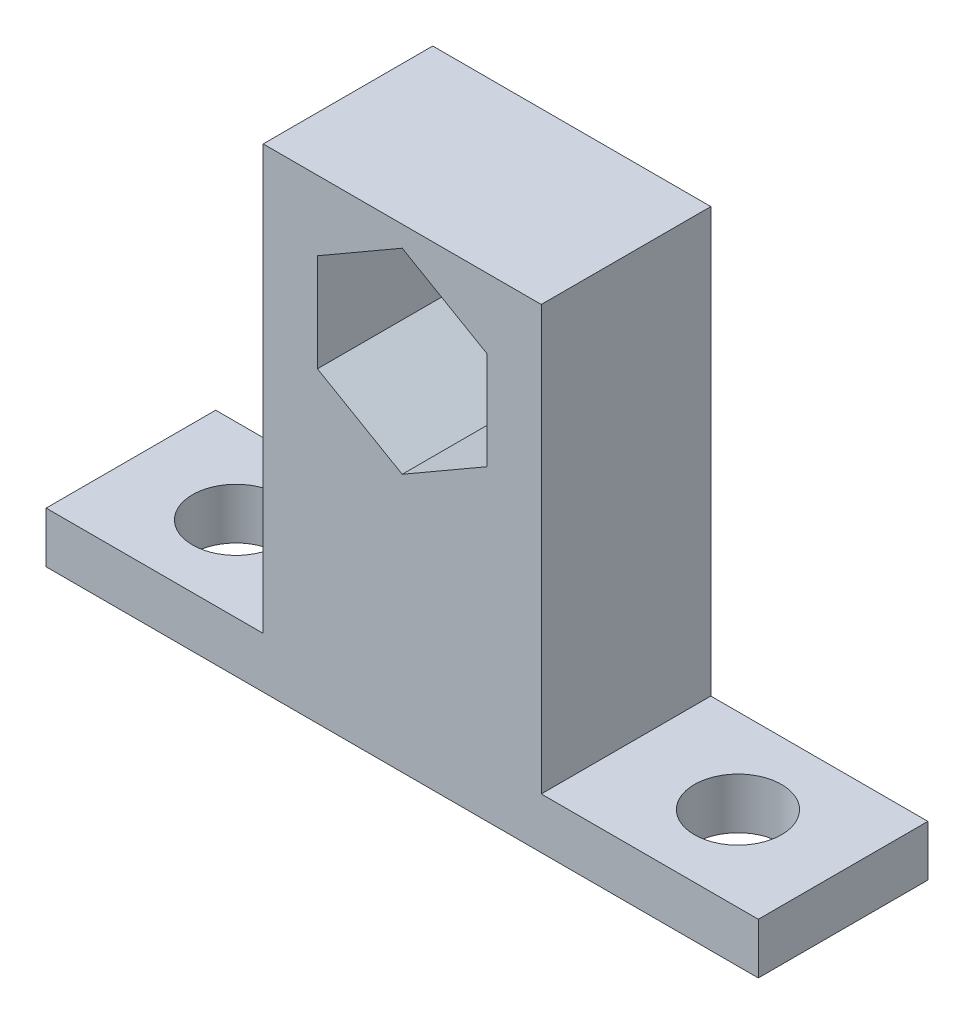
ISO-10303-21;
HEADER;
FILE_DESCRIPTION(('STEP AP214'),'2;1');
FILE_NAME('part.step','',(''),(''),'','','');
FILE_SCHEMA(('AUTOMOTIVE_DESIGN { 1 0 10303 214 1 1 1 1 }'));
ENDSEC;
DATA;
#1=APPLICATION_CONTEXT('core data for automotive mechanical design processes');
#2=APPLICATION_PROTOCOL_DEFINITION('international standard','automotive_design',2000,#1);
#3=PRODUCT_CONTEXT('',#1,'mechanical');
#4=PRODUCT('Part','Part','',(#3));
#5=PRODUCT_RELATED_PRODUCT_CATEGORY('part','',(#4));
#6=PRODUCT_DEFINITION_FORMATION('','',#4);
#7=PRODUCT_DEFINITION_CONTEXT('part definition',#1,'design');
#8=PRODUCT_DEFINITION('design','',#6,#7);
#9=PRODUCT_DEFINITION_SHAPE('','',#8);
#10=(LENGTH_UNIT() NAMED_UNIT(*) SI_UNIT(.MILLI.,.METRE.));
#11=(NAMED_UNIT(*) PLANE_ANGLE_UNIT() SI_UNIT($,.RADIAN.));
#12=(NAMED_UNIT(*) SI_UNIT($,.STERADIAN.) SOLID_ANGLE_UNIT());
#13=UNCERTAINTY_MEASURE_WITH_UNIT(LENGTH_MEASURE(1.E-05),#10,'distance_accuracy_value','');
#14=(GEOMETRIC_REPRESENTATION_CONTEXT(3) GLOBAL_UNCERTAINTY_ASSIGNED_CONTEXT((#13)) GLOBAL_UNIT_ASSIGNED_CONTEXT((#10,
#11,#12)) REPRESENTATION_CONTEXT('',''));
#15=CARTESIAN_POINT('',(0.,0.,0.));
#16=DIRECTION('',(0.,0.,1.));
#17=DIRECTION('',(1.,0.,0.));
#18=AXIS2_PLACEMENT_3D('',#15,#16,#17);
#19=CARTESIAN_POINT('',(0.,3.81,0.));
#20=DIRECTION('',(0.,1.,0.));
#21=DIRECTION('',(0.,0.,1.));
#22=AXIS2_PLACEMENT_3D('',#19,#20,#21);
#23=PLANE('',#22);
#24=DIRECTION('',(0.,0.,1.));
#25=VECTOR('',#24,1.);
#26=CARTESIAN_POINT('',(-19.1250455281497,3.81,9.58609075441454));
#27=LINE('',#26,#25);
#28=CARTESIAN_POINT('',(-19.1250455281497,3.81,-3.11390924558546));
#29=VERTEX_POINT('',#28);
#30=CARTESIAN_POINT('',(-19.1250455281497,3.81,9.58609075441454));
#31=VERTEX_POINT('',#30);
#32=EDGE_CURVE('E151',#29,#31,#27,.T.);
#33=ORIENTED_EDGE('',*,*,#32,.F.);
#34=DIRECTION('',(1.,0.,0.));
#35=VECTOR('',#34,1.);
#36=CARTESIAN_POINT('',(0.,3.81,-3.11390924558546));
#37=LINE('',#36,#35);
#38=CARTESIAN_POINT('',(-35.3810455281497,3.81,-3.11390924558546));
#39=VERTEX_POINT('',#38);
#40=EDGE_CURVE('E274',#39,#29,#37,.T.);
#41=ORIENTED_EDGE('',*,*,#40,.F.);
#42=DIRECTION('',(0.,0.,1.));
#43=VECTOR('',#42,1.);
#44=CARTESIAN_POINT('',(-35.3810455281497,3.81,0.));
#45=LINE('',#44,#43);
#46=CARTESIAN_POINT('',(-35.3810455281497,3.81,9.58609075441454));
#47=VERTEX_POINT('',#46);
#48=EDGE_CURVE('E272',#39,#47,#45,.T.);
#49=ORIENTED_EDGE('',*,*,#48,.T.);
#50=DIRECTION('',(1.,0.,0.));
#51=VECTOR('',#50,1.);
#52=CARTESIAN_POINT('',(0.,3.81,9.58609075441454));
#53=LINE('',#52,#51);
#54=EDGE_CURVE('E259',#47,#31,#53,.T.);
#55=ORIENTED_EDGE('',*,*,#54,.T.);
#56=EDGE_LOOP('',(#33,#41,#49,#55));
#57=FACE_BOUND('',#56,.T.);
#58=CARTESIAN_POINT('',(-27.5070455281497,3.81,3.23609075441454));
#59=DIRECTION('',(0.,1.,0.));
#60=DIRECTION('',(0.,0.,1.));
#61=AXIS2_PLACEMENT_3D('',#58,#59,#60);
#62=CIRCLE('',#61,3.2639);
#63=CARTESIAN_POINT('',(-27.5070455281497,3.81,6.49999075441454));
#64=VERTEX_POINT('',#63);
#65=EDGE_CURVE('E252',#64,#64,#62,.T.);
#66=ORIENTED_EDGE('',*,*,#65,.F.);
#67=EDGE_LOOP('',(#66));
#68=FACE_BOUND('',#67,.T.);
#69=ADVANCED_FACE('F35',(#57,#68),#23,.T.);
#70=CARTESIAN_POINT('',(0.,3.81,9.58609075441454));
#71=DIRECTION('',(0.,0.,-1.));
#72=DIRECTION('',(-1.,0.,0.));
#73=AXIS2_PLACEMENT_3D('',#70,#71,#72);
#74=PLANE('',#73);
#75=DIRECTION('',(0.,-1.,0.));
#76=VECTOR('',#75,1.);
#77=CARTESIAN_POINT('',(-15.0610455281497,23.0038257906459,9.58609075441454));
#78=LINE('',#77,#76);
#79=CARTESIAN_POINT('',(-15.0610455281497,30.3361742093541,9.58609075441454));
#80=VERTEX_POINT('',#79);
#81=CARTESIAN_POINT('',(-15.0610455281497,23.0038257906459,9.58609075441454));
#82=VERTEX_POINT('',#81);
#83=EDGE_CURVE('E158',#80,#82,#78,.T.);
#84=ORIENTED_EDGE('',*,*,#83,.F.);
#85=DIRECTION('',(-0.866025403784438,-0.5,0.));
#86=VECTOR('',#85,1.);
#87=CARTESIAN_POINT('',(-15.0610455281497,30.3361742093541,9.58609075441454));
#88=LINE('',#87,#86);
#89=CARTESIAN_POINT('',(-8.71104552814974,34.0023484187082,9.58609075441454));
#90=VERTEX_POINT('',#89);
#91=EDGE_CURVE('E139',#90,#80,#88,.T.);
#92=ORIENTED_EDGE('',*,*,#91,.F.);
#93=DIRECTION('',(-0.866025403784439,0.5,0.));
#94=VECTOR('',#93,1.);
#95=CARTESIAN_POINT('',(-8.71104552814974,34.0023484187082,9.58609075441454));
#96=LINE('',#95,#94);
#97=CARTESIAN_POINT('',(-2.36104552814974,30.3361742093541,9.58609075441454));
#98=VERTEX_POINT('',#97);
#99=EDGE_CURVE('E148',#98,#90,#96,.T.);
#100=ORIENTED_EDGE('',*,*,#99,.F.);
#101=DIRECTION('',(0.,1.,0.));
#102=VECTOR('',#101,1.);
#103=CARTESIAN_POINT('',(-2.36104552814974,30.3361742093541,9.58609075441454));
#104=LINE('',#103,#102);
#105=CARTESIAN_POINT('',(-2.36104552814974,23.0038257906459,9.58609075441454));
#106=VERTEX_POINT('',#105);
#107=EDGE_CURVE('E52',#106,#98,#104,.T.);
#108=ORIENTED_EDGE('',*,*,#107,.F.);
#109=DIRECTION('',(0.866025403784439,0.5,0.));
#110=VECTOR('',#109,1.);
#111=CARTESIAN_POINT('',(-2.36104552814974,23.0038257906459,9.58609075441454));
#112=LINE('',#111,#110);
#113=CARTESIAN_POINT('',(-8.71104552814974,19.3376515812918,9.58609075441454));
#114=VERTEX_POINT('',#113);
#115=EDGE_CURVE('E482',#114,#106,#112,.T.);
#116=ORIENTED_EDGE('',*,*,#115,.F.);
#117=DIRECTION('',(0.866025403784439,-0.5,0.));
#118=VECTOR('',#117,1.);
#119=CARTESIAN_POINT('',(-8.71104552814974,19.3376515812918,9.58609075441454));
#120=LINE('',#119,#118);
#121=EDGE_CURVE('E162',#82,#114,#120,.T.);
#122=ORIENTED_EDGE('',*,*,#121,.F.);
#123=EDGE_LOOP('',(#84,#92,#100,#108,#116,#122));
#124=FACE_BOUND('',#123,.T.);
#125=DIRECTION('',(1.,0.,0.));
#126=VECTOR('',#125,1.);
#127=CARTESIAN_POINT('',(0.,0.,9.58609075441454));
#128=LINE('',#127,#126);
#129=CARTESIAN_POINT('',(-35.3810455281497,0.,9.58609075441454));
#130=VERTEX_POINT('',#129);
#131=CARTESIAN_POINT('',(17.9589544718503,0.,9.58609075441454));
#132=VERTEX_POINT('',#131);
#133=EDGE_CURVE('E231',#130,#132,#128,.T.);
#134=ORIENTED_EDGE('',*,*,#133,.T.);
#135=DIRECTION('',(0.,-1.,0.));
#136=VECTOR('',#135,1.);
#137=CARTESIAN_POINT('',(17.9589544718503,3.81,9.58609075441454));
#138=LINE('',#137,#136);
#139=CARTESIAN_POINT('',(17.9589544718503,3.81,9.58609075441454));
#140=VERTEX_POINT('',#139);
#141=EDGE_CURVE('E11',#140,#132,#138,.T.);
#142=ORIENTED_EDGE('',*,*,#141,.F.);
#143=CARTESIAN_POINT('',(1.70295447185026,3.81,9.58609075441454));
#144=VERTEX_POINT('',#143);
#145=EDGE_CURVE('E263',#144,#140,#53,.T.);
#146=ORIENTED_EDGE('',*,*,#145,.F.);
#147=DIRECTION('',(0.,-1.,0.));
#148=VECTOR('',#147,1.);
#149=CARTESIAN_POINT('',(1.70295447185026,35.56,9.58609075441454));
#150=LINE('',#149,#148);
#151=CARTESIAN_POINT('',(1.70295447185026,35.56,9.58609075441454));
#152=VERTEX_POINT('',#151);
#153=EDGE_CURVE('E212',#152,#144,#150,.T.);
#154=ORIENTED_EDGE('',*,*,#153,.F.);
#155=DIRECTION('',(1.,0.,0.));
#156=VECTOR('',#155,1.);
#157=CARTESIAN_POINT('',(-19.1250455281497,35.56,9.58609075441454));
#158=LINE('',#157,#156);
#159=CARTESIAN_POINT('',(-19.1250455281497,35.56,9.58609075441454));
#160=VERTEX_POINT('',#159);
#161=EDGE_CURVE('E189',#160,#152,#158,.T.);
#162=ORIENTED_EDGE('',*,*,#161,.F.);
#163=DIRECTION('',(0.,-1.,0.));
#164=VECTOR('',#163,1.);
#165=CARTESIAN_POINT('',(-19.1250455281497,35.56,9.58609075441454));
#166=LINE('',#165,#164);
#167=EDGE_CURVE('E218',#160,#31,#166,.T.);
#168=ORIENTED_EDGE('',*,*,#167,.T.);
#169=ORIENTED_EDGE('',*,*,#54,.F.);
#170=DIRECTION('',(0.,-1.,0.));
#171=VECTOR('',#170,1.);
#172=CARTESIAN_POINT('',(-35.3810455281497,3.81,9.58609075441454));
#173=LINE('',#172,#171);
#174=EDGE_CURVE('E253',#47,#130,#173,.T.);
#175=ORIENTED_EDGE('',*,*,#174,.T.);
#176=EDGE_LOOP('',(#134,#142,#146,#154,#162,#168,#169,#175));
#177=FACE_BOUND('',#176,.T.);
#178=ADVANCED_FACE('F154',(#124,#177),#74,.F.);
#179=CARTESIAN_POINT('',(17.9589544718503,3.81,0.));
#180=DIRECTION('',(1.,0.,0.));
#181=DIRECTION('',(0.,0.,-1.));
#182=AXIS2_PLACEMENT_3D('',#179,#180,#181);
#183=PLANE('',#182);
#184=DIRECTION('',(0.,0.,1.));
#185=VECTOR('',#184,1.);
#186=CARTESIAN_POINT('',(17.9589544718503,0.,0.));
#187=LINE('',#186,#185);
#188=CARTESIAN_POINT('',(17.9589544718503,0.,-3.11390924558546));
#189=VERTEX_POINT('',#188);
#190=EDGE_CURVE('E236',#189,#132,#187,.T.);
#191=ORIENTED_EDGE('',*,*,#190,.F.);
#192=DIRECTION('',(0.,-1.,0.));
#193=VECTOR('',#192,1.);
#194=CARTESIAN_POINT('',(17.9589544718503,3.81,-3.11390924558546));
#195=LINE('',#194,#193);
#196=CARTESIAN_POINT('',(17.9589544718503,3.81,-3.11390924558546));
#197=VERTEX_POINT('',#196);
#198=EDGE_CURVE('E44',#197,#189,#195,.T.);
#199=ORIENTED_EDGE('',*,*,#198,.F.);
#200=DIRECTION('',(0.,0.,1.));
#201=VECTOR('',#200,1.);
#202=CARTESIAN_POINT('',(17.9589544718503,3.81,0.));
#203=LINE('',#202,#201);
#204=EDGE_CURVE('E262',#197,#140,#203,.T.);
#205=ORIENTED_EDGE('',*,*,#204,.T.);
#206=ORIENTED_EDGE('',*,*,#141,.T.);
#207=EDGE_LOOP('',(#191,#199,#205,#206));
#208=FACE_BOUND('',#207,.T.);
#209=ADVANCED_FACE('F285',(#208),#183,.T.);
#210=CARTESIAN_POINT('',(0.,3.81,-3.11390924558546));
#211=DIRECTION('',(0.,0.,-1.));
#212=DIRECTION('',(-1.,0.,0.));
#213=AXIS2_PLACEMENT_3D('',#210,#211,#212);
#214=PLANE('',#213);
#215=DIRECTION('',(0.866025403784438,0.5,0.));
#216=VECTOR('',#215,1.);
#217=CARTESIAN_POINT('',(-15.0610455281497,30.3361742093541,-3.11390924558546));
#218=LINE('',#217,#216);
#219=CARTESIAN_POINT('',(-15.0610455281497,30.3361742093541,-3.11390924558546));
#220=VERTEX_POINT('',#219);
#221=CARTESIAN_POINT('',(-8.71104552814974,34.0023484187082,-3.11390924558546));
#222=VERTEX_POINT('',#221);
#223=EDGE_CURVE('E60',#220,#222,#218,.T.);
#224=ORIENTED_EDGE('',*,*,#223,.F.);
#225=DIRECTION('',(0.,1.,0.));
#226=VECTOR('',#225,1.);
#227=CARTESIAN_POINT('',(-15.0610455281497,23.0038257906459,-3.11390924558546));
#228=LINE('',#227,#226);
#229=CARTESIAN_POINT('',(-15.0610455281497,23.0038257906459,-3.11390924558546));
#230=VERTEX_POINT('',#229);
#231=EDGE_CURVE('E145',#230,#220,#228,.T.);
#232=ORIENTED_EDGE('',*,*,#231,.F.);
#233=DIRECTION('',(-0.866025403784439,0.499999999999999,0.));
#234=VECTOR('',#233,1.);
#235=CARTESIAN_POINT('',(-8.71104552814974,19.3376515812918,-3.11390924558546));
#236=LINE('',#235,#234);
#237=CARTESIAN_POINT('',(-8.71104552814974,19.3376515812918,-3.11390924558546));
#238=VERTEX_POINT('',#237);
#239=EDGE_CURVE('E173',#238,#230,#236,.T.);
#240=ORIENTED_EDGE('',*,*,#239,.F.);
#241=DIRECTION('',(-0.866025403784439,-0.5,0.));
#242=VECTOR('',#241,1.);
#243=CARTESIAN_POINT('',(-2.36104552814974,23.0038257906459,-3.11390924558546));
#244=LINE('',#243,#242);
#245=CARTESIAN_POINT('',(-2.36104552814974,23.0038257906459,-3.11390924558546));
#246=VERTEX_POINT('',#245);
#247=EDGE_CURVE('E170',#246,#238,#244,.T.);
#248=ORIENTED_EDGE('',*,*,#247,.F.);
#249=DIRECTION('',(0.,-1.,0.));
#250=VECTOR('',#249,1.);
#251=CARTESIAN_POINT('',(-2.36104552814974,30.3361742093541,-3.11390924558546));
#252=LINE('',#251,#250);
#253=CARTESIAN_POINT('',(-2.36104552814974,30.3361742093541,-3.11390924558546));
#254=VERTEX_POINT('',#253);
#255=EDGE_CURVE('E167',#254,#246,#252,.T.);
#256=ORIENTED_EDGE('',*,*,#255,.F.);
#257=DIRECTION('',(0.866025403784439,-0.5,0.));
#258=VECTOR('',#257,1.);
#259=CARTESIAN_POINT('',(-8.71104552814974,34.0023484187082,-3.11390924558546));
#260=LINE('',#259,#258);
#261=EDGE_CURVE('E160',#222,#254,#260,.T.);
#262=ORIENTED_EDGE('',*,*,#261,.F.);
#263=EDGE_LOOP('',(#224,#232,#240,#248,#256,#262));
#264=FACE_BOUND('',#263,.T.);
#265=DIRECTION('',(1.,0.,0.));
#266=VECTOR('',#265,1.);
#267=CARTESIAN_POINT('',(0.,0.,-3.11390924558546));
#268=LINE('',#267,#266);
#269=CARTESIAN_POINT('',(-35.3810455281497,0.,-3.11390924558546));
#270=VERTEX_POINT('',#269);
#271=EDGE_CURVE('E244',#270,#189,#268,.T.);
#272=ORIENTED_EDGE('',*,*,#271,.F.);
#273=DIRECTION('',(0.,-1.,0.));
#274=VECTOR('',#273,1.);
#275=CARTESIAN_POINT('',(-35.3810455281497,3.81,-3.11390924558546));
#276=LINE('',#275,#274);
#277=EDGE_CURVE('E256',#39,#270,#276,.T.);
#278=ORIENTED_EDGE('',*,*,#277,.F.);
#279=ORIENTED_EDGE('',*,*,#40,.T.);
#280=DIRECTION('',(0.,-1.,0.));
#281=VECTOR('',#280,1.);
#282=CARTESIAN_POINT('',(-19.1250455281497,35.56,-3.11390924558546));
#283=LINE('',#282,#281);
#284=CARTESIAN_POINT('',(-19.1250455281497,35.56,-3.11390924558546));
#285=VERTEX_POINT('',#284);
#286=EDGE_CURVE('E196',#285,#29,#283,.T.);
#287=ORIENTED_EDGE('',*,*,#286,.F.);
#288=DIRECTION('',(-1.,0.,0.));
#289=VECTOR('',#288,1.);
#290=CARTESIAN_POINT('',(-19.1250455281497,35.56,-3.11390924558546));
#291=LINE('',#290,#289);
#292=CARTESIAN_POINT('',(1.70295447185026,35.56,-3.11390924558546));
#293=VERTEX_POINT('',#292);
#294=EDGE_CURVE('E194',#293,#285,#291,.T.);
#295=ORIENTED_EDGE('',*,*,#294,.F.);
#296=DIRECTION('',(0.,-1.,0.));
#297=VECTOR('',#296,1.);
#298=CARTESIAN_POINT('',(1.70295447185026,35.56,-3.11390924558546));
#299=LINE('',#298,#297);
#300=CARTESIAN_POINT('',(1.70295447185026,3.81,-3.11390924558546));
#301=VERTEX_POINT('',#300);
#302=EDGE_CURVE('E207',#293,#301,#299,.T.);
#303=ORIENTED_EDGE('',*,*,#302,.T.);
#304=EDGE_CURVE('E270',#301,#197,#37,.T.);
#305=ORIENTED_EDGE('',*,*,#304,.T.);
#306=ORIENTED_EDGE('',*,*,#198,.T.);
#307=EDGE_LOOP('',(#272,#278,#279,#287,#295,#303,#305,#306));
#308=FACE_BOUND('',#307,.T.);
#309=ADVANCED_FACE('F279',(#264,#308),#214,.T.);
#310=CARTESIAN_POINT('',(-35.3810455281497,3.81,0.));
#311=DIRECTION('',(1.,0.,0.));
#312=DIRECTION('',(0.,0.,-1.));
#313=AXIS2_PLACEMENT_3D('',#310,#311,#312);
#314=PLANE('',#313);
#315=DIRECTION('',(0.,0.,1.));
#316=VECTOR('',#315,1.);
#317=CARTESIAN_POINT('',(-35.3810455281497,0.,0.));
#318=LINE('',#317,#316);
#319=EDGE_CURVE('E247',#270,#130,#318,.T.);
#320=ORIENTED_EDGE('',*,*,#319,.T.);
#321=ORIENTED_EDGE('',*,*,#174,.F.);
#322=ORIENTED_EDGE('',*,*,#48,.F.);
#323=ORIENTED_EDGE('',*,*,#277,.T.);
#324=EDGE_LOOP('',(#320,#321,#322,#323));
#325=FACE_BOUND('',#324,.T.);
#326=ADVANCED_FACE('F299',(#325),#314,.F.);
#327=CARTESIAN_POINT('',(-27.5070455281497,3.81,3.23609075441454));
#328=DIRECTION('',(0.,-1.,0.));
#329=DIRECTION('',(0.,0.,-1.));
#330=AXIS2_PLACEMENT_3D('',#327,#328,#329);
#331=CYLINDRICAL_SURFACE('',#330,3.2639);
#332=ORIENTED_EDGE('',*,*,#65,.T.);
#333=EDGE_LOOP('',(#332));
#334=FACE_BOUND('',#333,.T.);
#335=CARTESIAN_POINT('',(-27.5070455281497,0.,3.23609075441454));
#336=DIRECTION('',(0.,1.,0.));
#337=DIRECTION('',(0.,0.,1.));
#338=AXIS2_PLACEMENT_3D('',#335,#336,#337);
#339=CIRCLE('',#338,3.2639);
#340=CARTESIAN_POINT('',(-27.5070455281497,0.,6.49999075441454));
#341=VERTEX_POINT('',#340);
#342=EDGE_CURVE('E227',#341,#341,#339,.T.);
#343=ORIENTED_EDGE('',*,*,#342,.F.);
#344=EDGE_LOOP('',(#343));
#345=FACE_BOUND('',#344,.T.);
#346=ADVANCED_FACE('F37',(#334,#345),#331,.F.);
#347=CARTESIAN_POINT('',(10.0849544718503,3.81,3.23609075441454));
#348=DIRECTION('',(0.,-1.,0.));
#349=DIRECTION('',(0.,0.,-1.));
#350=AXIS2_PLACEMENT_3D('',#347,#348,#349);
#351=CYLINDRICAL_SURFACE('',#350,3.26390000000001);
#352=CARTESIAN_POINT('',(10.0849544718503,3.81,3.23609075441454));
#353=DIRECTION('',(0.,1.,0.));
#354=DIRECTION('',(0.,0.,1.));
#355=AXIS2_PLACEMENT_3D('',#352,#353,#354);
#356=CIRCLE('',#355,3.26390000000001);
#357=CARTESIAN_POINT('',(10.0849544718503,3.81,6.49999075441455));
#358=VERTEX_POINT('',#357);
#359=EDGE_CURVE('E239',#358,#358,#356,.T.);
#360=ORIENTED_EDGE('',*,*,#359,.T.);
#361=EDGE_LOOP('',(#360));
#362=FACE_BOUND('',#361,.T.);
#363=CARTESIAN_POINT('',(10.0849544718503,0.,3.23609075441454));
#364=DIRECTION('',(0.,1.,0.));
#365=DIRECTION('',(0.,0.,1.));
#366=AXIS2_PLACEMENT_3D('',#363,#364,#365);
#367=CIRCLE('',#366,3.26390000000001);
#368=CARTESIAN_POINT('',(10.0849544718503,0.,6.49999075441455));
#369=VERTEX_POINT('',#368);
#370=EDGE_CURVE('E249',#369,#369,#367,.T.);
#371=ORIENTED_EDGE('',*,*,#370,.F.);
#372=EDGE_LOOP('',(#371));
#373=FACE_BOUND('',#372,.T.);
#374=ADVANCED_FACE('F323',(#362,#373),#351,.F.);
#375=DIRECTION('',(0.,0.,-1.));
#376=VECTOR('',#375,1.);
#377=CARTESIAN_POINT('',(1.70295447185026,3.81,9.58609075441454));
#378=LINE('',#377,#376);
#379=EDGE_CURVE('E190',#144,#301,#378,.T.);
#380=ORIENTED_EDGE('',*,*,#379,.F.);
#381=ORIENTED_EDGE('',*,*,#145,.T.);
#382=ORIENTED_EDGE('',*,*,#204,.F.);
#383=ORIENTED_EDGE('',*,*,#304,.F.);
#384=EDGE_LOOP('',(#380,#381,#382,#383));
#385=FACE_BOUND('',#384,.T.);
#386=ORIENTED_EDGE('',*,*,#359,.F.);
#387=EDGE_LOOP('',(#386));
#388=FACE_BOUND('',#387,.T.);
#389=ADVANCED_FACE('F286',(#385,#388),#23,.T.);
#390=CARTESIAN_POINT('',(0.,0.,0.));
#391=DIRECTION('',(0.,1.,0.));
#392=DIRECTION('',(0.,0.,1.));
#393=AXIS2_PLACEMENT_3D('',#390,#391,#392);
#394=PLANE('',#393);
#395=ORIENTED_EDGE('',*,*,#342,.T.);
#396=EDGE_LOOP('',(#395));
#397=FACE_BOUND('',#396,.T.);
#398=ORIENTED_EDGE('',*,*,#133,.F.);
#399=ORIENTED_EDGE('',*,*,#319,.F.);
#400=ORIENTED_EDGE('',*,*,#271,.T.);
#401=ORIENTED_EDGE('',*,*,#190,.T.);
#402=EDGE_LOOP('',(#398,#399,#400,#401));
#403=FACE_BOUND('',#402,.T.);
#404=ORIENTED_EDGE('',*,*,#370,.T.);
#405=EDGE_LOOP('',(#404));
#406=FACE_BOUND('',#405,.T.);
#407=ADVANCED_FACE('F295',(#397,#403,#406),#394,.F.);
#408=CARTESIAN_POINT('',(-19.1250455281497,35.56,9.58609075441454));
#409=DIRECTION('',(1.,0.,0.));
#410=DIRECTION('',(0.,0.,-1.));
#411=AXIS2_PLACEMENT_3D('',#408,#409,#410);
#412=PLANE('',#411);
#413=ORIENTED_EDGE('',*,*,#32,.T.);
#414=ORIENTED_EDGE('',*,*,#167,.F.);
#415=DIRECTION('',(0.,0.,1.));
#416=VECTOR('',#415,1.);
#417=CARTESIAN_POINT('',(-19.1250455281497,35.56,9.58609075441454));
#418=LINE('',#417,#416);
#419=EDGE_CURVE('E186',#285,#160,#418,.T.);
#420=ORIENTED_EDGE('',*,*,#419,.F.);
#421=ORIENTED_EDGE('',*,*,#286,.T.);
#422=EDGE_LOOP('',(#413,#414,#420,#421));
#423=FACE_BOUND('',#422,.T.);
#424=ADVANCED_FACE('F302',(#423),#412,.F.);
#425=CARTESIAN_POINT('',(1.70295447185026,35.56,9.58609075441454));
#426=DIRECTION('',(-1.,0.,0.));
#427=DIRECTION('',(0.,0.,1.));
#428=AXIS2_PLACEMENT_3D('',#425,#426,#427);
#429=PLANE('',#428);
#430=ORIENTED_EDGE('',*,*,#379,.T.);
#431=ORIENTED_EDGE('',*,*,#302,.F.);
#432=DIRECTION('',(0.,0.,-1.));
#433=VECTOR('',#432,1.);
#434=CARTESIAN_POINT('',(1.70295447185026,35.56,9.58609075441454));
#435=LINE('',#434,#433);
#436=EDGE_CURVE('E192',#152,#293,#435,.T.);
#437=ORIENTED_EDGE('',*,*,#436,.F.);
#438=ORIENTED_EDGE('',*,*,#153,.T.);
#439=EDGE_LOOP('',(#430,#431,#437,#438));
#440=FACE_BOUND('',#439,.T.);
#441=ADVANCED_FACE('F307',(#440),#429,.F.);
#442=CARTESIAN_POINT('',(0.,35.56,0.));
#443=DIRECTION('',(0.,-1.,0.));
#444=DIRECTION('',(0.,0.,-1.));
#445=AXIS2_PLACEMENT_3D('',#442,#443,#444);
#446=PLANE('',#445);
#447=ORIENTED_EDGE('',*,*,#419,.T.);
#448=ORIENTED_EDGE('',*,*,#161,.T.);
#449=ORIENTED_EDGE('',*,*,#436,.T.);
#450=ORIENTED_EDGE('',*,*,#294,.T.);
#451=EDGE_LOOP('',(#447,#448,#449,#450));
#452=FACE_BOUND('',#451,.T.);
#453=ADVANCED_FACE('F304',(#452),#446,.F.);
#454=CARTESIAN_POINT('',(-15.0610455281497,30.3361742093541,9.58714075441454));
#455=DIRECTION('',(-0.5,0.866025403784438,0.));
#456=DIRECTION('',(-0.866025403784438,-0.5,0.));
#457=AXIS2_PLACEMENT_3D('',#454,#455,#456);
#458=PLANE('',#457);
#459=ORIENTED_EDGE('',*,*,#91,.T.);
#460=DIRECTION('',(0.,0.,-1.));
#461=VECTOR('',#460,1.);
#462=CARTESIAN_POINT('',(-15.0610455281497,30.3361742093541,9.58714075441454));
#463=LINE('',#462,#461);
#464=EDGE_CURVE('E152',#80,#220,#463,.T.);
#465=ORIENTED_EDGE('',*,*,#464,.T.);
#466=ORIENTED_EDGE('',*,*,#223,.T.);
#467=DIRECTION('',(0.,0.,-1.));
#468=VECTOR('',#467,1.);
#469=CARTESIAN_POINT('',(-8.71104552814974,34.0023484187082,9.58714075441454));
#470=LINE('',#469,#468);
#471=EDGE_CURVE('E135',#90,#222,#470,.T.);
#472=ORIENTED_EDGE('',*,*,#471,.F.);
#473=EDGE_LOOP('',(#459,#465,#466,#472));
#474=FACE_BOUND('',#473,.T.);
#475=ADVANCED_FACE('F137',(#474),#458,.F.);
#476=CARTESIAN_POINT('',(-15.0610455281497,23.0038257906459,9.58714075441454));
#477=DIRECTION('',(-1.,0.,0.));
#478=DIRECTION('',(0.,0.,1.));
#479=AXIS2_PLACEMENT_3D('',#476,#477,#478);
#480=PLANE('',#479);
#481=ORIENTED_EDGE('',*,*,#83,.T.);
#482=DIRECTION('',(0.,0.,-1.));
#483=VECTOR('',#482,1.);
#484=CARTESIAN_POINT('',(-15.0610455281497,23.0038257906459,9.58714075441454));
#485=LINE('',#484,#483);
#486=EDGE_CURVE('E179',#82,#230,#485,.T.);
#487=ORIENTED_EDGE('',*,*,#486,.T.);
#488=ORIENTED_EDGE('',*,*,#231,.T.);
#489=ORIENTED_EDGE('',*,*,#464,.F.);
#490=EDGE_LOOP('',(#481,#487,#488,#489));
#491=FACE_BOUND('',#490,.T.);
#492=ADVANCED_FACE('F430',(#491),#480,.F.);
#493=CARTESIAN_POINT('',(-8.71104552814974,19.3376515812918,9.58714075441454));
#494=DIRECTION('',(-0.5,-0.866025403784439,0.));
#495=DIRECTION('',(0.866025403784439,-0.5,0.));
#496=AXIS2_PLACEMENT_3D('',#493,#494,#495);
#497=PLANE('',#496);
#498=ORIENTED_EDGE('',*,*,#121,.T.);
#499=DIRECTION('',(0.,0.,-1.));
#500=VECTOR('',#499,1.);
#501=CARTESIAN_POINT('',(-8.71104552814974,19.3376515812918,9.58714075441454));
#502=LINE('',#501,#500);
#503=EDGE_CURVE('E181',#114,#238,#502,.T.);
#504=ORIENTED_EDGE('',*,*,#503,.T.);
#505=ORIENTED_EDGE('',*,*,#239,.T.);
#506=ORIENTED_EDGE('',*,*,#486,.F.);
#507=EDGE_LOOP('',(#498,#504,#505,#506));
#508=FACE_BOUND('',#507,.T.);
#509=ADVANCED_FACE('F436',(#508),#497,.F.);
#510=CARTESIAN_POINT('',(-2.36104552814974,23.0038257906459,9.58714075441454));
#511=DIRECTION('',(0.5,-0.866025403784439,0.));
#512=DIRECTION('',(0.866025403784439,0.5,0.));
#513=AXIS2_PLACEMENT_3D('',#510,#511,#512);
#514=PLANE('',#513);
#515=ORIENTED_EDGE('',*,*,#115,.T.);
#516=DIRECTION('',(0.,0.,-1.));
#517=VECTOR('',#516,1.);
#518=CARTESIAN_POINT('',(-2.36104552814974,23.0038257906459,9.58714075441454));
#519=LINE('',#518,#517);
#520=EDGE_CURVE('E183',#106,#246,#519,.T.);
#521=ORIENTED_EDGE('',*,*,#520,.T.);
#522=ORIENTED_EDGE('',*,*,#247,.T.);
#523=ORIENTED_EDGE('',*,*,#503,.F.);
#524=EDGE_LOOP('',(#515,#521,#522,#523));
#525=FACE_BOUND('',#524,.T.);
#526=ADVANCED_FACE('F444',(#525),#514,.F.);
#527=CARTESIAN_POINT('',(-2.36104552814974,30.3361742093541,9.58714075441454));
#528=DIRECTION('',(1.,0.,0.));
#529=DIRECTION('',(0.,1.,0.));
#530=AXIS2_PLACEMENT_3D('',#527,#528,#529);
#531=PLANE('',#530);
#532=ORIENTED_EDGE('',*,*,#107,.T.);
#533=DIRECTION('',(0.,0.,-1.));
#534=VECTOR('',#533,1.);
#535=CARTESIAN_POINT('',(-2.36104552814974,30.3361742093541,9.58714075441454));
#536=LINE('',#535,#534);
#537=EDGE_CURVE('E144',#98,#254,#536,.T.);
#538=ORIENTED_EDGE('',*,*,#537,.T.);
#539=ORIENTED_EDGE('',*,*,#255,.T.);
#540=ORIENTED_EDGE('',*,*,#520,.F.);
#541=EDGE_LOOP('',(#532,#538,#539,#540));
#542=FACE_BOUND('',#541,.T.);
#543=ADVANCED_FACE('F452',(#542),#531,.F.);
#544=CARTESIAN_POINT('',(-8.71104552814974,34.0023484187082,9.58714075441454));
#545=DIRECTION('',(0.5,0.866025403784439,0.));
#546=DIRECTION('',(-0.866025403784439,0.5,0.));
#547=AXIS2_PLACEMENT_3D('',#544,#545,#546);
#548=PLANE('',#547);
#549=ORIENTED_EDGE('',*,*,#99,.T.);
#550=ORIENTED_EDGE('',*,*,#471,.T.);
#551=ORIENTED_EDGE('',*,*,#261,.T.);
#552=ORIENTED_EDGE('',*,*,#537,.F.);
#553=EDGE_LOOP('',(#549,#550,#551,#552));
#554=FACE_BOUND('',#553,.T.);
#555=ADVANCED_FACE('F149',(#554),#548,.F.);
#556=CLOSED_SHELL('',(#69,#178,#209,#309,#326,#346,#374,#389,#407,#424,#441,#453,#475,#492,#509,
#526,#543,#555));
#557=MANIFOLD_SOLID_BREP('B2',#556);
#558=ADVANCED_BREP_SHAPE_REPRESENTATION('',(#18,#557),#14);
#559=SHAPE_DEFINITION_REPRESENTATION(#9,#558);
ENDSEC;
END-ISO-10303-21;
